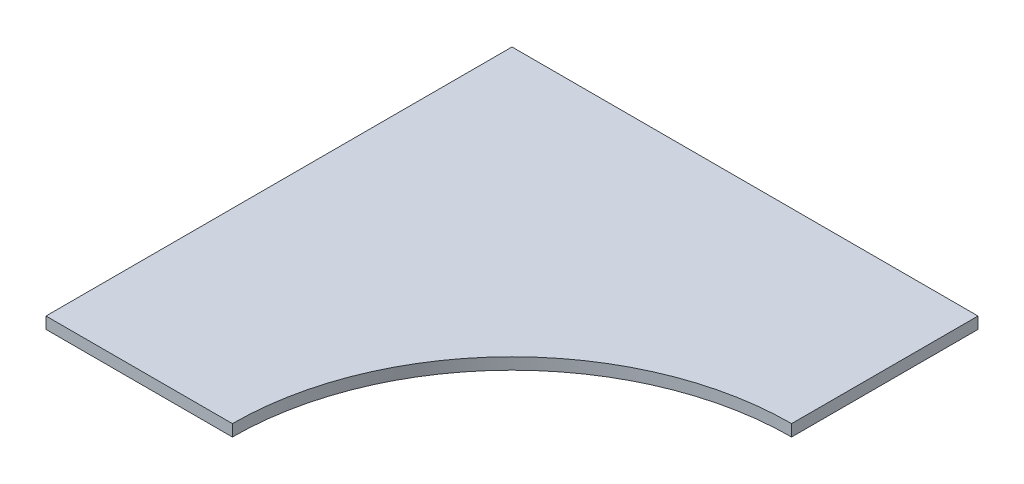
ISO-10303-21;
HEADER;
FILE_DESCRIPTION(('STEP AP214'),'2;1');
FILE_NAME('part.step','',(''),(''),'','','');
FILE_SCHEMA(('AUTOMOTIVE_DESIGN { 1 0 10303 214 1 1 1 1 }'));
ENDSEC;
DATA;
#1=APPLICATION_CONTEXT('core data for automotive mechanical design processes');
#2=APPLICATION_PROTOCOL_DEFINITION('international standard','automotive_design',2000,#1);
#3=PRODUCT_CONTEXT('',#1,'mechanical');
#4=PRODUCT('Part','Part','',(#3));
#5=PRODUCT_RELATED_PRODUCT_CATEGORY('part','',(#4));
#6=PRODUCT_DEFINITION_FORMATION('','',#4);
#7=PRODUCT_DEFINITION_CONTEXT('part definition',#1,'design');
#8=PRODUCT_DEFINITION('design','',#6,#7);
#9=PRODUCT_DEFINITION_SHAPE('','',#8);
#10=(LENGTH_UNIT() NAMED_UNIT(*) SI_UNIT(.MILLI.,.METRE.));
#11=(NAMED_UNIT(*) PLANE_ANGLE_UNIT() SI_UNIT($,.RADIAN.));
#12=(NAMED_UNIT(*) SI_UNIT($,.STERADIAN.) SOLID_ANGLE_UNIT());
#13=UNCERTAINTY_MEASURE_WITH_UNIT(LENGTH_MEASURE(1.E-05),#10,'distance_accuracy_value','');
#14=(GEOMETRIC_REPRESENTATION_CONTEXT(3) GLOBAL_UNCERTAINTY_ASSIGNED_CONTEXT((#13)) GLOBAL_UNIT_ASSIGNED_CONTEXT((#10,
#11,#12)) REPRESENTATION_CONTEXT('',''));
#15=CARTESIAN_POINT('',(0.,0.,0.));
#16=DIRECTION('',(0.,0.,1.));
#17=DIRECTION('',(1.,0.,0.));
#18=AXIS2_PLACEMENT_3D('',#15,#16,#17);
#19=CARTESIAN_POINT('',(0.,3.175,0.));
#20=DIRECTION('',(0.,0.,-1.));
#21=DIRECTION('',(-1.,0.,0.));
#22=AXIS2_PLACEMENT_3D('',#19,#20,#21);
#23=PLANE('',#22);
#24=DIRECTION('',(1.,0.,0.));
#25=VECTOR('',#24,1.);
#26=CARTESIAN_POINT('',(0.,0.,0.));
#27=LINE('',#26,#25);
#28=CARTESIAN_POINT('',(0.,0.,0.));
#29=VERTEX_POINT('',#28);
#30=CARTESIAN_POINT('',(50.8,0.,0.));
#31=VERTEX_POINT('',#30);
#32=EDGE_CURVE('E118',#29,#31,#27,.T.);
#33=ORIENTED_EDGE('',*,*,#32,.T.);
#34=DIRECTION('',(0.,-1.,0.));
#35=VECTOR('',#34,1.);
#36=CARTESIAN_POINT('',(50.8,3.175,0.));
#37=LINE('',#36,#35);
#38=CARTESIAN_POINT('',(50.8,3.175,0.));
#39=VERTEX_POINT('',#38);
#40=EDGE_CURVE('E11',#39,#31,#37,.T.);
#41=ORIENTED_EDGE('',*,*,#40,.F.);
#42=DIRECTION('',(1.,0.,0.));
#43=VECTOR('',#42,1.);
#44=CARTESIAN_POINT('',(0.,3.175,0.));
#45=LINE('',#44,#43);
#46=CARTESIAN_POINT('',(0.,3.175,0.));
#47=VERTEX_POINT('',#46);
#48=EDGE_CURVE('E131',#47,#39,#45,.T.);
#49=ORIENTED_EDGE('',*,*,#48,.F.);
#50=DIRECTION('',(0.,-1.,0.));
#51=VECTOR('',#50,1.);
#52=CARTESIAN_POINT('',(0.,3.175,0.));
#53=LINE('',#52,#51);
#54=EDGE_CURVE('E114',#47,#29,#53,.T.);
#55=ORIENTED_EDGE('',*,*,#54,.T.);
#56=EDGE_LOOP('',(#33,#41,#49,#55));
#57=FACE_BOUND('',#56,.T.);
#58=ADVANCED_FACE('F39',(#57),#23,.F.);
#59=CARTESIAN_POINT('',(127.,3.175,0.));
#60=DIRECTION('',(0.,-1.,0.));
#61=DIRECTION('',(0.,0.,-1.));
#62=AXIS2_PLACEMENT_3D('',#59,#60,#61);
#63=CYLINDRICAL_SURFACE('',#62,76.2);
#64=CARTESIAN_POINT('',(127.,0.,0.));
#65=DIRECTION('',(0.,-1.,0.));
#66=DIRECTION('',(0.,0.,-1.));
#67=AXIS2_PLACEMENT_3D('',#64,#65,#66);
#68=CIRCLE('',#67,76.2);
#69=CARTESIAN_POINT('',(127.,0.,-76.2));
#70=VERTEX_POINT('',#69);
#71=EDGE_CURVE('E122',#31,#70,#68,.T.);
#72=ORIENTED_EDGE('',*,*,#71,.T.);
#73=DIRECTION('',(0.,-1.,0.));
#74=VECTOR('',#73,1.);
#75=CARTESIAN_POINT('',(127.,3.175,-76.2));
#76=LINE('',#75,#74);
#77=CARTESIAN_POINT('',(127.,3.175,-76.2));
#78=VERTEX_POINT('',#77);
#79=EDGE_CURVE('E48',#78,#70,#76,.T.);
#80=ORIENTED_EDGE('',*,*,#79,.F.);
#81=CARTESIAN_POINT('',(127.,3.175,0.));
#82=DIRECTION('',(0.,-1.,0.));
#83=DIRECTION('',(0.,0.,-1.));
#84=AXIS2_PLACEMENT_3D('',#81,#82,#83);
#85=CIRCLE('',#84,76.2);
#86=EDGE_CURVE('E90',#39,#78,#85,.T.);
#87=ORIENTED_EDGE('',*,*,#86,.F.);
#88=ORIENTED_EDGE('',*,*,#40,.T.);
#89=EDGE_LOOP('',(#72,#80,#87,#88));
#90=FACE_BOUND('',#89,.T.);
#91=ADVANCED_FACE('F153',(#90),#63,.F.);
#92=CARTESIAN_POINT('',(127.,3.175,-127.));
#93=DIRECTION('',(-1.,0.,0.));
#94=DIRECTION('',(0.,0.,1.));
#95=AXIS2_PLACEMENT_3D('',#92,#93,#94);
#96=PLANE('',#95);
#97=DIRECTION('',(0.,0.,-1.));
#98=VECTOR('',#97,1.);
#99=CARTESIAN_POINT('',(127.,0.,-127.));
#100=LINE('',#99,#98);
#101=CARTESIAN_POINT('',(127.,0.,-127.));
#102=VERTEX_POINT('',#101);
#103=EDGE_CURVE('E106',#70,#102,#100,.T.);
#104=ORIENTED_EDGE('',*,*,#103,.T.);
#105=DIRECTION('',(0.,-1.,0.));
#106=VECTOR('',#105,1.);
#107=CARTESIAN_POINT('',(127.,3.175,-127.));
#108=LINE('',#107,#106);
#109=CARTESIAN_POINT('',(127.,3.175,-127.));
#110=VERTEX_POINT('',#109);
#111=EDGE_CURVE('E103',#110,#102,#108,.T.);
#112=ORIENTED_EDGE('',*,*,#111,.F.);
#113=DIRECTION('',(0.,0.,-1.));
#114=VECTOR('',#113,1.);
#115=CARTESIAN_POINT('',(127.,3.175,-127.));
#116=LINE('',#115,#114);
#117=EDGE_CURVE('E94',#78,#110,#116,.T.);
#118=ORIENTED_EDGE('',*,*,#117,.F.);
#119=ORIENTED_EDGE('',*,*,#79,.T.);
#120=EDGE_LOOP('',(#104,#112,#118,#119));
#121=FACE_BOUND('',#120,.T.);
#122=ADVANCED_FACE('F104',(#121),#96,.F.);
#123=CARTESIAN_POINT('',(0.,3.175,-127.));
#124=DIRECTION('',(0.,0.,1.));
#125=DIRECTION('',(1.,0.,0.));
#126=AXIS2_PLACEMENT_3D('',#123,#124,#125);
#127=PLANE('',#126);
#128=DIRECTION('',(-1.,0.,0.));
#129=VECTOR('',#128,1.);
#130=CARTESIAN_POINT('',(0.,0.,-127.));
#131=LINE('',#130,#129);
#132=CARTESIAN_POINT('',(0.,0.,-127.));
#133=VERTEX_POINT('',#132);
#134=EDGE_CURVE('E76',#102,#133,#131,.T.);
#135=ORIENTED_EDGE('',*,*,#134,.T.);
#136=DIRECTION('',(0.,-1.,0.));
#137=VECTOR('',#136,1.);
#138=CARTESIAN_POINT('',(0.,3.175,-127.));
#139=LINE('',#138,#137);
#140=CARTESIAN_POINT('',(0.,3.175,-127.));
#141=VERTEX_POINT('',#140);
#142=EDGE_CURVE('E108',#141,#133,#139,.T.);
#143=ORIENTED_EDGE('',*,*,#142,.F.);
#144=DIRECTION('',(-1.,0.,0.));
#145=VECTOR('',#144,1.);
#146=CARTESIAN_POINT('',(0.,3.175,-127.));
#147=LINE('',#146,#145);
#148=EDGE_CURVE('E98',#110,#141,#147,.T.);
#149=ORIENTED_EDGE('',*,*,#148,.F.);
#150=ORIENTED_EDGE('',*,*,#111,.T.);
#151=EDGE_LOOP('',(#135,#143,#149,#150));
#152=FACE_BOUND('',#151,.T.);
#153=ADVANCED_FACE('F110',(#152),#127,.F.);
#154=CARTESIAN_POINT('',(0.,3.175,0.));
#155=DIRECTION('',(1.,0.,0.));
#156=DIRECTION('',(0.,0.,-1.));
#157=AXIS2_PLACEMENT_3D('',#154,#155,#156);
#158=PLANE('',#157);
#159=DIRECTION('',(0.,0.,1.));
#160=VECTOR('',#159,1.);
#161=CARTESIAN_POINT('',(0.,0.,0.));
#162=LINE('',#161,#160);
#163=EDGE_CURVE('E82',#133,#29,#162,.T.);
#164=ORIENTED_EDGE('',*,*,#163,.T.);
#165=ORIENTED_EDGE('',*,*,#54,.F.);
#166=DIRECTION('',(0.,0.,1.));
#167=VECTOR('',#166,1.);
#168=CARTESIAN_POINT('',(0.,3.175,0.));
#169=LINE('',#168,#167);
#170=EDGE_CURVE('E56',#141,#47,#169,.T.);
#171=ORIENTED_EDGE('',*,*,#170,.F.);
#172=ORIENTED_EDGE('',*,*,#142,.T.);
#173=EDGE_LOOP('',(#164,#165,#171,#172));
#174=FACE_BOUND('',#173,.T.);
#175=ADVANCED_FACE('F142',(#174),#158,.F.);
#176=CARTESIAN_POINT('',(127.,3.175,0.));
#177=DIRECTION('',(0.,-1.,0.));
#178=DIRECTION('',(0.,0.,-1.));
#179=AXIS2_PLACEMENT_3D('',#176,#177,#178);
#180=PLANE('',#179);
#181=ORIENTED_EDGE('',*,*,#48,.T.);
#182=ORIENTED_EDGE('',*,*,#86,.T.);
#183=ORIENTED_EDGE('',*,*,#117,.T.);
#184=ORIENTED_EDGE('',*,*,#148,.T.);
#185=ORIENTED_EDGE('',*,*,#170,.T.);
#186=EDGE_LOOP('',(#181,#182,#183,#184,#185));
#187=FACE_BOUND('',#186,.T.);
#188=ADVANCED_FACE('F96',(#187),#180,.F.);
#189=CARTESIAN_POINT('',(127.,0.,0.));
#190=DIRECTION('',(0.,-1.,0.));
#191=DIRECTION('',(0.,0.,-1.));
#192=AXIS2_PLACEMENT_3D('',#189,#190,#191);
#193=PLANE('',#192);
#194=ORIENTED_EDGE('',*,*,#32,.F.);
#195=ORIENTED_EDGE('',*,*,#163,.F.);
#196=ORIENTED_EDGE('',*,*,#134,.F.);
#197=ORIENTED_EDGE('',*,*,#103,.F.);
#198=ORIENTED_EDGE('',*,*,#71,.F.);
#199=EDGE_LOOP('',(#194,#195,#196,#197,#198));
#200=FACE_BOUND('',#199,.T.);
#201=ADVANCED_FACE('F138',(#200),#193,.T.);
#202=CLOSED_SHELL('',(#58,#91,#122,#153,#175,#188,#201));
#203=MANIFOLD_SOLID_BREP('B2',#202);
#204=ADVANCED_BREP_SHAPE_REPRESENTATION('',(#18,#203),#14);
#205=SHAPE_DEFINITION_REPRESENTATION(#9,#204);
ENDSEC;
END-ISO-10303-21;
